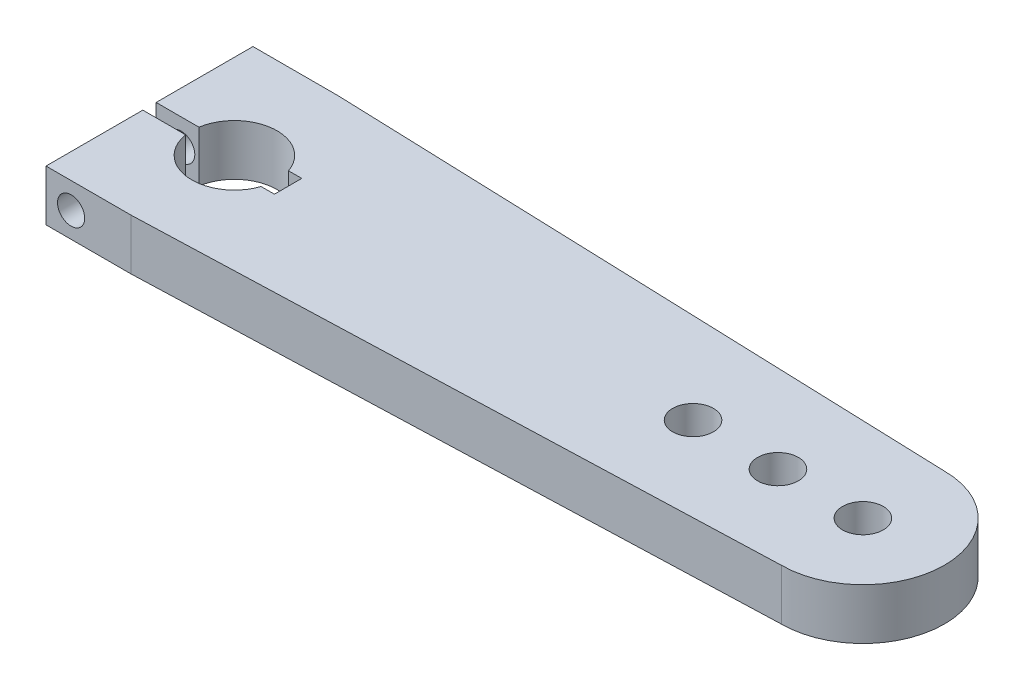
ISO-10303-21;
HEADER;
FILE_DESCRIPTION(('STEP AP214'),'2;1');
FILE_NAME('part.step','',(''),(''),'','','');
FILE_SCHEMA(('AUTOMOTIVE_DESIGN { 1 0 10303 214 1 1 1 1 }'));
ENDSEC;
DATA;
#1=APPLICATION_CONTEXT('core data for automotive mechanical design processes');
#2=APPLICATION_PROTOCOL_DEFINITION('international standard','automotive_design',2000,#1);
#3=PRODUCT_CONTEXT('',#1,'mechanical');
#4=PRODUCT('Part','Part','',(#3));
#5=PRODUCT_RELATED_PRODUCT_CATEGORY('part','',(#4));
#6=PRODUCT_DEFINITION_FORMATION('','',#4);
#7=PRODUCT_DEFINITION_CONTEXT('part definition',#1,'design');
#8=PRODUCT_DEFINITION('design','',#6,#7);
#9=PRODUCT_DEFINITION_SHAPE('','',#8);
#10=(LENGTH_UNIT() NAMED_UNIT(*) SI_UNIT(.MILLI.,.METRE.));
#11=(NAMED_UNIT(*) PLANE_ANGLE_UNIT() SI_UNIT($,.RADIAN.));
#12=(NAMED_UNIT(*) SI_UNIT($,.STERADIAN.) SOLID_ANGLE_UNIT());
#13=UNCERTAINTY_MEASURE_WITH_UNIT(LENGTH_MEASURE(1.E-05),#10,'distance_accuracy_value','');
#14=(GEOMETRIC_REPRESENTATION_CONTEXT(3) GLOBAL_UNCERTAINTY_ASSIGNED_CONTEXT((#13)) GLOBAL_UNIT_ASSIGNED_CONTEXT((#10,
#11,#12)) REPRESENTATION_CONTEXT('',''));
#15=CARTESIAN_POINT('',(0.,0.,0.));
#16=DIRECTION('',(0.,0.,1.));
#17=DIRECTION('',(1.,0.,0.));
#18=AXIS2_PLACEMENT_3D('',#15,#16,#17);
#19=CARTESIAN_POINT('',(92.1574881088771,15.,2.77365509217572));
#20=DIRECTION('',(0.,-1.,0.));
#21=DIRECTION('',(0.,0.,-1.));
#22=AXIS2_PLACEMENT_3D('',#19,#20,#21);
#23=PLANE('',#22);
#24=CARTESIAN_POINT('',(67.1574881088771,15.,2.77365509217573));
#25=DIRECTION('',(0.,1.,0.));
#26=DIRECTION('',(0.,0.,1.));
#27=AXIS2_PLACEMENT_3D('',#24,#25,#26);
#28=CIRCLE('',#27,6.);
#29=CARTESIAN_POINT('',(67.1574881088771,15.,8.77365509217573));
#30=VERTEX_POINT('',#29);
#31=EDGE_CURVE('E172',#30,#30,#28,.T.);
#32=ORIENTED_EDGE('',*,*,#31,.F.);
#33=EDGE_LOOP('',(#32));
#34=FACE_BOUND('',#33,.T.);
#35=CARTESIAN_POINT('',(42.1574881088771,15.,2.77365509217573));
#36=DIRECTION('',(0.,1.,0.));
#37=DIRECTION('',(0.,0.,1.));
#38=AXIS2_PLACEMENT_3D('',#35,#36,#37);
#39=CIRCLE('',#38,6.00000000000001);
#40=CARTESIAN_POINT('',(42.1574881088771,15.,8.77365509217573));
#41=VERTEX_POINT('',#40);
#42=EDGE_CURVE('E254',#41,#41,#39,.T.);
#43=ORIENTED_EDGE('',*,*,#42,.F.);
#44=EDGE_LOOP('',(#43));
#45=FACE_BOUND('',#44,.T.);
#46=CARTESIAN_POINT('',(92.1574881088771,15.,2.77365509217573));
#47=DIRECTION('',(0.,1.,0.));
#48=DIRECTION('',(0.,0.,1.));
#49=AXIS2_PLACEMENT_3D('',#46,#47,#48);
#50=CIRCLE('',#49,6.);
#51=CARTESIAN_POINT('',(92.1574881088771,15.,8.77365509217573));
#52=VERTEX_POINT('',#51);
#53=EDGE_CURVE('E248',#52,#52,#50,.T.);
#54=ORIENTED_EDGE('',*,*,#53,.F.);
#55=EDGE_LOOP('',(#54));
#56=FACE_BOUND('',#55,.T.);
#57=DIRECTION('',(1.,0.,0.));
#58=VECTOR('',#57,1.);
#59=CARTESIAN_POINT('',(-124.013504929194,15.,0.813312736203185));
#60=LINE('',#59,#58);
#61=CARTESIAN_POINT('',(-117.842511891123,15.,0.813312736203185));
#62=VERTEX_POINT('',#61);
#63=CARTESIAN_POINT('',(-105.238461142688,15.,0.813312736203186));
#64=VERTEX_POINT('',#63);
#65=EDGE_CURVE('E149',#62,#64,#60,.T.);
#66=ORIENTED_EDGE('',*,*,#65,.T.);
#67=CARTESIAN_POINT('',(-92.8425118911229,15.,2.77365509217573));
#68=DIRECTION('',(0.,1.,0.));
#69=DIRECTION('',(0.,0.,1.));
#70=AXIS2_PLACEMENT_3D('',#67,#68,#69);
#71=CIRCLE('',#70,12.55);
#72=CARTESIAN_POINT('',(-80.955465369804,15.,-1.25134490782428));
#73=VERTEX_POINT('',#72);
#74=EDGE_CURVE('E215',#73,#64,#71,.T.);
#75=ORIENTED_EDGE('',*,*,#74,.F.);
#76=DIRECTION('',(-1.,0.,0.));
#77=VECTOR('',#76,1.);
#78=CARTESIAN_POINT('',(-80.955465369804,15.,-1.25134490782428));
#79=LINE('',#78,#77);
#80=CARTESIAN_POINT('',(-77.0425118911229,15.,-1.25134490782428));
#81=VERTEX_POINT('',#80);
#82=EDGE_CURVE('E223',#81,#73,#79,.T.);
#83=ORIENTED_EDGE('',*,*,#82,.F.);
#84=DIRECTION('',(0.,0.,-1.));
#85=VECTOR('',#84,1.);
#86=CARTESIAN_POINT('',(-77.0425118911229,15.,-1.25134490782428));
#87=LINE('',#86,#85);
#88=CARTESIAN_POINT('',(-77.0425118911229,15.,6.79865509217572));
#89=VERTEX_POINT('',#88);
#90=EDGE_CURVE('E220',#89,#81,#87,.T.);
#91=ORIENTED_EDGE('',*,*,#90,.F.);
#92=DIRECTION('',(1.,0.,0.));
#93=VECTOR('',#92,1.);
#94=CARTESIAN_POINT('',(-80.955465369804,15.,6.79865509217572));
#95=LINE('',#94,#93);
#96=CARTESIAN_POINT('',(-80.955465369804,15.,6.79865509217572));
#97=VERTEX_POINT('',#96);
#98=EDGE_CURVE('E218',#97,#89,#95,.T.);
#99=ORIENTED_EDGE('',*,*,#98,.F.);
#100=CARTESIAN_POINT('',(-105.238461142688,15.,4.7339974481497));
#101=VERTEX_POINT('',#100);
#102=EDGE_CURVE('E148',#101,#97,#71,.T.);
#103=ORIENTED_EDGE('',*,*,#102,.F.);
#104=DIRECTION('',(1.,0.,0.));
#105=VECTOR('',#104,1.);
#106=CARTESIAN_POINT('',(-124.013504929194,15.,4.7339974481497));
#107=LINE('',#106,#105);
#108=CARTESIAN_POINT('',(-117.842511891123,15.,4.7339974481497));
#109=VERTEX_POINT('',#108);
#110=EDGE_CURVE('E49',#109,#101,#107,.T.);
#111=ORIENTED_EDGE('',*,*,#110,.F.);
#112=DIRECTION('',(0.,0.,1.));
#113=VECTOR('',#112,1.);
#114=CARTESIAN_POINT('',(-117.842511891123,15.,-27.6866872637968));
#115=LINE('',#114,#113);
#116=CARTESIAN_POINT('',(-117.842511891123,15.,33.2339974481497));
#117=VERTEX_POINT('',#116);
#118=EDGE_CURVE('E145',#109,#117,#115,.T.);
#119=ORIENTED_EDGE('',*,*,#118,.T.);
#120=DIRECTION('',(1.,0.,0.));
#121=VECTOR('',#120,1.);
#122=CARTESIAN_POINT('',(-92.8425118911229,15.,33.2339974481497));
#123=LINE('',#122,#121);
#124=CARTESIAN_POINT('',(-92.8425118911229,15.,33.2339974481497));
#125=VERTEX_POINT('',#124);
#126=EDGE_CURVE('E159',#117,#125,#123,.T.);
#127=ORIENTED_EDGE('',*,*,#126,.T.);
#128=DIRECTION('',(0.999390827019096,0.,-0.0348994967025044));
#129=VECTOR('',#128,1.);
#130=CARTESIAN_POINT('',(-92.8425118911229,15.,33.2339974481497));
#131=LINE('',#130,#129);
#132=CARTESIAN_POINT('',(92.1574881088771,15.,26.7736550921757));
#133=VERTEX_POINT('',#132);
#134=EDGE_CURVE('E165',#125,#133,#131,.T.);
#135=ORIENTED_EDGE('',*,*,#134,.T.);
#136=CARTESIAN_POINT('',(92.1574881088771,15.,2.77365509217572));
#137=DIRECTION('',(0.,1.,0.));
#138=DIRECTION('',(0.,0.,-1.));
#139=AXIS2_PLACEMENT_3D('',#136,#137,#138);
#140=CIRCLE('',#139,24.);
#141=CARTESIAN_POINT('',(92.1574881088771,15.,-21.2263449078243));
#142=VERTEX_POINT('',#141);
#143=EDGE_CURVE('E184',#133,#142,#140,.T.);
#144=ORIENTED_EDGE('',*,*,#143,.T.);
#145=DIRECTION('',(-0.999390827019096,0.,-0.0348994967024967));
#146=VECTOR('',#145,1.);
#147=CARTESIAN_POINT('',(-92.8425118911229,15.,-27.6866872637968));
#148=LINE('',#147,#146);
#149=CARTESIAN_POINT('',(-92.8425118911229,15.,-27.6866872637968));
#150=VERTEX_POINT('',#149);
#151=EDGE_CURVE('E160',#142,#150,#148,.T.);
#152=ORIENTED_EDGE('',*,*,#151,.T.);
#153=DIRECTION('',(-1.,0.,0.));
#154=VECTOR('',#153,1.);
#155=CARTESIAN_POINT('',(-92.8425118911229,15.,-27.6866872637968));
#156=LINE('',#155,#154);
#157=CARTESIAN_POINT('',(-117.842511891123,15.,-27.6866872637968));
#158=VERTEX_POINT('',#157);
#159=EDGE_CURVE('E156',#150,#158,#156,.T.);
#160=ORIENTED_EDGE('',*,*,#159,.T.);
#161=EDGE_CURVE('E155',#158,#62,#115,.T.);
#162=ORIENTED_EDGE('',*,*,#161,.T.);
#163=EDGE_LOOP('',(#66,#75,#83,#91,#99,#103,#111,#119,#127,#135,#144,#152,#160,#162));
#164=FACE_BOUND('',#163,.T.);
#165=ADVANCED_FACE('F32',(#34,#45,#56,#164),#23,.F.);
#166=CARTESIAN_POINT('',(92.1574881088771,0.,2.77365509217572));
#167=DIRECTION('',(0.,-1.,0.));
#168=DIRECTION('',(0.,0.,-1.));
#169=AXIS2_PLACEMENT_3D('',#166,#167,#168);
#170=PLANE('',#169);
#171=CARTESIAN_POINT('',(42.1574881088771,0.,2.77365509217573));
#172=DIRECTION('',(0.,1.,0.));
#173=DIRECTION('',(0.,0.,1.));
#174=AXIS2_PLACEMENT_3D('',#171,#172,#173);
#175=CIRCLE('',#174,6.00000000000001);
#176=CARTESIAN_POINT('',(42.1574881088771,0.,8.77365509217573));
#177=VERTEX_POINT('',#176);
#178=EDGE_CURVE('E251',#177,#177,#175,.T.);
#179=ORIENTED_EDGE('',*,*,#178,.T.);
#180=EDGE_LOOP('',(#179));
#181=FACE_BOUND('',#180,.T.);
#182=CARTESIAN_POINT('',(67.1574881088771,0.,2.77365509217573));
#183=DIRECTION('',(0.,1.,0.));
#184=DIRECTION('',(0.,0.,1.));
#185=AXIS2_PLACEMENT_3D('',#182,#183,#184);
#186=CIRCLE('',#185,6.);
#187=CARTESIAN_POINT('',(67.1574881088771,0.,8.77365509217573));
#188=VERTEX_POINT('',#187);
#189=EDGE_CURVE('E257',#188,#188,#186,.T.);
#190=ORIENTED_EDGE('',*,*,#189,.T.);
#191=EDGE_LOOP('',(#190));
#192=FACE_BOUND('',#191,.T.);
#193=CARTESIAN_POINT('',(92.1574881088771,0.,2.77365509217573));
#194=DIRECTION('',(0.,1.,0.));
#195=DIRECTION('',(0.,0.,1.));
#196=AXIS2_PLACEMENT_3D('',#193,#194,#195);
#197=CIRCLE('',#196,6.);
#198=CARTESIAN_POINT('',(92.1574881088771,0.,8.77365509217573));
#199=VERTEX_POINT('',#198);
#200=EDGE_CURVE('E247',#199,#199,#197,.T.);
#201=ORIENTED_EDGE('',*,*,#200,.T.);
#202=EDGE_LOOP('',(#201));
#203=FACE_BOUND('',#202,.T.);
#204=CARTESIAN_POINT('',(-92.8425118911229,0.,2.77365509217573));
#205=DIRECTION('',(0.,1.,0.));
#206=DIRECTION('',(0.,0.,1.));
#207=AXIS2_PLACEMENT_3D('',#204,#205,#206);
#208=CIRCLE('',#207,12.55);
#209=CARTESIAN_POINT('',(-80.955465369804,0.,-1.25134490782427));
#210=VERTEX_POINT('',#209);
#211=CARTESIAN_POINT('',(-105.238461142688,0.,0.813312736203187));
#212=VERTEX_POINT('',#211);
#213=EDGE_CURVE('E226',#210,#212,#208,.T.);
#214=ORIENTED_EDGE('',*,*,#213,.T.);
#215=DIRECTION('',(1.,0.,0.));
#216=VECTOR('',#215,1.);
#217=CARTESIAN_POINT('',(-124.013504929194,0.,0.813312736203185));
#218=LINE('',#217,#216);
#219=CARTESIAN_POINT('',(-117.842511891123,0.,0.813312736203185));
#220=VERTEX_POINT('',#219);
#221=EDGE_CURVE('E57',#220,#212,#218,.T.);
#222=ORIENTED_EDGE('',*,*,#221,.F.);
#223=DIRECTION('',(0.,0.,1.));
#224=VECTOR('',#223,1.);
#225=CARTESIAN_POINT('',(-117.842511891123,0.,-27.6866872637968));
#226=LINE('',#225,#224);
#227=CARTESIAN_POINT('',(-117.842511891123,0.,-27.6866872637968));
#228=VERTEX_POINT('',#227);
#229=EDGE_CURVE('E177',#228,#220,#226,.T.);
#230=ORIENTED_EDGE('',*,*,#229,.F.);
#231=DIRECTION('',(-1.,0.,0.));
#232=VECTOR('',#231,1.);
#233=CARTESIAN_POINT('',(-92.8425118911229,0.,-27.6866872637968));
#234=LINE('',#233,#232);
#235=CARTESIAN_POINT('',(-92.8425118911229,0.,-27.6866872637968));
#236=VERTEX_POINT('',#235);
#237=EDGE_CURVE('E174',#236,#228,#234,.T.);
#238=ORIENTED_EDGE('',*,*,#237,.F.);
#239=DIRECTION('',(-0.999390827019096,0.,-0.0348994967024967));
#240=VECTOR('',#239,1.);
#241=CARTESIAN_POINT('',(-92.8425118911229,0.,-27.6866872637968));
#242=LINE('',#241,#240);
#243=CARTESIAN_POINT('',(92.1574881088771,0.,-21.2263449078243));
#244=VERTEX_POINT('',#243);
#245=EDGE_CURVE('E171',#244,#236,#242,.T.);
#246=ORIENTED_EDGE('',*,*,#245,.F.);
#247=CARTESIAN_POINT('',(92.1574881088771,0.,2.77365509217572));
#248=DIRECTION('',(0.,1.,0.));
#249=DIRECTION('',(0.,0.,-1.));
#250=AXIS2_PLACEMENT_3D('',#247,#248,#249);
#251=CIRCLE('',#250,24.);
#252=CARTESIAN_POINT('',(92.1574881088771,0.,26.7736550921757));
#253=VERTEX_POINT('',#252);
#254=EDGE_CURVE('E168',#253,#244,#251,.T.);
#255=ORIENTED_EDGE('',*,*,#254,.F.);
#256=DIRECTION('',(0.999390827019096,0.,-0.0348994967025044));
#257=VECTOR('',#256,1.);
#258=CARTESIAN_POINT('',(-92.8425118911229,0.,33.2339974481497));
#259=LINE('',#258,#257);
#260=CARTESIAN_POINT('',(-92.8425118911229,0.,33.2339974481497));
#261=VERTEX_POINT('',#260);
#262=EDGE_CURVE('E182',#261,#253,#259,.T.);
#263=ORIENTED_EDGE('',*,*,#262,.F.);
#264=DIRECTION('',(1.,0.,0.));
#265=VECTOR('',#264,1.);
#266=CARTESIAN_POINT('',(-92.8425118911229,0.,33.2339974481497));
#267=LINE('',#266,#265);
#268=CARTESIAN_POINT('',(-117.842511891123,0.,33.2339974481497));
#269=VERTEX_POINT('',#268);
#270=EDGE_CURVE('E180',#269,#261,#267,.T.);
#271=ORIENTED_EDGE('',*,*,#270,.F.);
#272=CARTESIAN_POINT('',(-117.842511891123,0.,4.7339974481497));
#273=VERTEX_POINT('',#272);
#274=EDGE_CURVE('E176',#273,#269,#226,.T.);
#275=ORIENTED_EDGE('',*,*,#274,.F.);
#276=DIRECTION('',(1.,0.,0.));
#277=VECTOR('',#276,1.);
#278=CARTESIAN_POINT('',(-124.013504929194,0.,4.7339974481497));
#279=LINE('',#278,#277);
#280=CARTESIAN_POINT('',(-105.238461142688,0.,4.7339974481497));
#281=VERTEX_POINT('',#280);
#282=EDGE_CURVE('E136',#273,#281,#279,.T.);
#283=ORIENTED_EDGE('',*,*,#282,.T.);
#284=CARTESIAN_POINT('',(-80.955465369804,0.,6.79865509217572));
#285=VERTEX_POINT('',#284);
#286=EDGE_CURVE('E214',#281,#285,#208,.T.);
#287=ORIENTED_EDGE('',*,*,#286,.T.);
#288=DIRECTION('',(1.,0.,0.));
#289=VECTOR('',#288,1.);
#290=CARTESIAN_POINT('',(-80.955465369804,0.,6.79865509217572));
#291=LINE('',#290,#289);
#292=CARTESIAN_POINT('',(-77.0425118911229,0.,6.79865509217572));
#293=VERTEX_POINT('',#292);
#294=EDGE_CURVE('E229',#285,#293,#291,.T.);
#295=ORIENTED_EDGE('',*,*,#294,.T.);
#296=DIRECTION('',(0.,0.,-1.));
#297=VECTOR('',#296,1.);
#298=CARTESIAN_POINT('',(-77.0425118911229,0.,-1.25134490782428));
#299=LINE('',#298,#297);
#300=CARTESIAN_POINT('',(-77.0425118911229,0.,-1.25134490782428));
#301=VERTEX_POINT('',#300);
#302=EDGE_CURVE('E232',#293,#301,#299,.T.);
#303=ORIENTED_EDGE('',*,*,#302,.T.);
#304=DIRECTION('',(-1.,0.,0.));
#305=VECTOR('',#304,1.);
#306=CARTESIAN_POINT('',(-80.955465369804,0.,-1.25134490782428));
#307=LINE('',#306,#305);
#308=EDGE_CURVE('E235',#301,#210,#307,.T.);
#309=ORIENTED_EDGE('',*,*,#308,.T.);
#310=EDGE_LOOP('',(#214,#222,#230,#238,#246,#255,#263,#271,#275,#283,#287,#295,#303,#309));
#311=FACE_BOUND('',#310,.T.);
#312=ADVANCED_FACE('F289',(#181,#192,#203,#311),#170,.T.);
#313=CARTESIAN_POINT('',(-117.842511891123,15.,-27.6866872637968));
#314=DIRECTION('',(1.,0.,0.));
#315=DIRECTION('',(0.,0.,-1.));
#316=AXIS2_PLACEMENT_3D('',#313,#314,#315);
#317=PLANE('',#316);
#318=DIRECTION('',(0.,-1.,0.));
#319=VECTOR('',#318,1.);
#320=CARTESIAN_POINT('',(-117.842511891123,15.,0.813312736203185));
#321=LINE('',#320,#319);
#322=EDGE_CURVE('E206',#62,#220,#321,.T.);
#323=ORIENTED_EDGE('',*,*,#322,.F.);
#324=ORIENTED_EDGE('',*,*,#161,.F.);
#325=DIRECTION('',(0.,-1.,0.));
#326=VECTOR('',#325,1.);
#327=CARTESIAN_POINT('',(-117.842511891123,15.,-27.6866872637968));
#328=LINE('',#327,#326);
#329=EDGE_CURVE('E191',#158,#228,#328,.T.);
#330=ORIENTED_EDGE('',*,*,#329,.T.);
#331=ORIENTED_EDGE('',*,*,#229,.T.);
#332=EDGE_LOOP('',(#323,#324,#330,#331));
#333=FACE_BOUND('',#332,.T.);
#334=ADVANCED_FACE('F279',(#333),#317,.F.);
#335=CARTESIAN_POINT('',(-92.8425118911229,15.,2.77365509217573));
#336=DIRECTION('',(0.,-1.,0.));
#337=DIRECTION('',(0.,0.,-1.));
#338=AXIS2_PLACEMENT_3D('',#335,#336,#337);
#339=CYLINDRICAL_SURFACE('',#338,12.55);
#340=ORIENTED_EDGE('',*,*,#74,.T.);
#341=DIRECTION('',(0.,-1.,0.));
#342=VECTOR('',#341,1.);
#343=CARTESIAN_POINT('',(-105.238461142688,15.,0.813312736203186));
#344=LINE('',#343,#342);
#345=EDGE_CURVE('E204',#64,#212,#344,.T.);
#346=ORIENTED_EDGE('',*,*,#345,.T.);
#347=ORIENTED_EDGE('',*,*,#213,.F.);
#348=DIRECTION('',(0.,-1.,0.));
#349=VECTOR('',#348,1.);
#350=CARTESIAN_POINT('',(-80.955465369804,15.,-1.25134490782428));
#351=LINE('',#350,#349);
#352=EDGE_CURVE('E225',#73,#210,#351,.T.);
#353=ORIENTED_EDGE('',*,*,#352,.F.);
#354=EDGE_LOOP('',(#340,#346,#347,#353));
#355=FACE_BOUND('',#354,.T.);
#356=ADVANCED_FACE('F284',(#355),#339,.F.);
#357=CARTESIAN_POINT('',(-110.462160830366,7.3692509347012,33.2339974481497));
#358=DIRECTION('',(0.,0.,-1.));
#359=DIRECTION('',(-1.,0.,0.));
#360=AXIS2_PLACEMENT_3D('',#357,#358,#359);
#361=CYLINDRICAL_SURFACE('',#360,4.00000000000001);
#362=CARTESIAN_POINT('',(-110.462160830366,7.3692509347012,-27.6866872637968));
#363=DIRECTION('',(0.,0.,-1.));
#364=DIRECTION('',(-1.,0.,0.));
#365=AXIS2_PLACEMENT_3D('',#362,#363,#364);
#366=CIRCLE('',#365,4.00000000000001);
#367=CARTESIAN_POINT('',(-114.462160830366,7.3692509347012,-27.6866872637968));
#368=VERTEX_POINT('',#367);
#369=EDGE_CURVE('E208',#368,#368,#366,.T.);
#370=ORIENTED_EDGE('',*,*,#369,.T.);
#371=EDGE_LOOP('',(#370));
#372=FACE_BOUND('',#371,.T.);
#373=CARTESIAN_POINT('',(-110.462160830366,7.3692509347012,0.813312736203185));
#374=DIRECTION('',(0.,0.,1.));
#375=DIRECTION('',(1.,0.,0.));
#376=AXIS2_PLACEMENT_3D('',#373,#374,#375);
#377=CIRCLE('',#376,4.00000000000001);
#378=CARTESIAN_POINT('',(-106.462160830366,7.3692509347012,0.813312736203185));
#379=VERTEX_POINT('',#378);
#380=EDGE_CURVE('E36',#379,#379,#377,.F.);
#381=ORIENTED_EDGE('',*,*,#380,.F.);
#382=EDGE_LOOP('',(#381));
#383=FACE_BOUND('',#382,.T.);
#384=ADVANCED_FACE('F314',(#372,#383),#361,.F.);
#385=CARTESIAN_POINT('',(92.1574881088771,15.,2.77365509217572));
#386=DIRECTION('',(0.,-1.,0.));
#387=DIRECTION('',(0.,0.,-1.));
#388=AXIS2_PLACEMENT_3D('',#385,#386,#387);
#389=CYLINDRICAL_SURFACE('',#388,24.);
#390=ORIENTED_EDGE('',*,*,#254,.T.);
#391=DIRECTION('',(0.,-1.,0.));
#392=VECTOR('',#391,1.);
#393=CARTESIAN_POINT('',(92.1574881088771,15.,-21.2263449078243));
#394=LINE('',#393,#392);
#395=EDGE_CURVE('E11',#142,#244,#394,.T.);
#396=ORIENTED_EDGE('',*,*,#395,.F.);
#397=ORIENTED_EDGE('',*,*,#143,.F.);
#398=DIRECTION('',(0.,-1.,0.));
#399=VECTOR('',#398,1.);
#400=CARTESIAN_POINT('',(92.1574881088771,15.,26.7736550921757));
#401=LINE('',#400,#399);
#402=EDGE_CURVE('E167',#133,#253,#401,.T.);
#403=ORIENTED_EDGE('',*,*,#402,.T.);
#404=EDGE_LOOP('',(#390,#396,#397,#403));
#405=FACE_BOUND('',#404,.T.);
#406=ADVANCED_FACE('F34',(#405),#389,.T.);
#407=CARTESIAN_POINT('',(-92.8425118911229,15.,-27.6866872637968));
#408=DIRECTION('',(-0.0348994967024967,0.,0.999390827019096));
#409=DIRECTION('',(0.999390827019096,0.,0.0348994967024967));
#410=AXIS2_PLACEMENT_3D('',#407,#408,#409);
#411=PLANE('',#410);
#412=ORIENTED_EDGE('',*,*,#245,.T.);
#413=DIRECTION('',(0.,-1.,0.));
#414=VECTOR('',#413,1.);
#415=CARTESIAN_POINT('',(-92.8425118911229,15.,-27.6866872637968));
#416=LINE('',#415,#414);
#417=EDGE_CURVE('E41',#150,#236,#416,.T.);
#418=ORIENTED_EDGE('',*,*,#417,.F.);
#419=ORIENTED_EDGE('',*,*,#151,.F.);
#420=ORIENTED_EDGE('',*,*,#395,.T.);
#421=EDGE_LOOP('',(#412,#418,#419,#420));
#422=FACE_BOUND('',#421,.T.);
#423=ADVANCED_FACE('F271',(#422),#411,.F.);
#424=CARTESIAN_POINT('',(-92.8425118911229,15.,-27.6866872637968));
#425=DIRECTION('',(0.,0.,1.));
#426=DIRECTION('',(1.,0.,0.));
#427=AXIS2_PLACEMENT_3D('',#424,#425,#426);
#428=PLANE('',#427);
#429=ORIENTED_EDGE('',*,*,#369,.F.);
#430=EDGE_LOOP('',(#429));
#431=FACE_BOUND('',#430,.T.);
#432=ORIENTED_EDGE('',*,*,#237,.T.);
#433=ORIENTED_EDGE('',*,*,#329,.F.);
#434=ORIENTED_EDGE('',*,*,#159,.F.);
#435=ORIENTED_EDGE('',*,*,#417,.T.);
#436=EDGE_LOOP('',(#432,#433,#434,#435));
#437=FACE_BOUND('',#436,.T.);
#438=ADVANCED_FACE('F274',(#431,#437),#428,.F.);
#439=ORIENTED_EDGE('',*,*,#118,.F.);
#440=DIRECTION('',(0.,-1.,0.));
#441=VECTOR('',#440,1.);
#442=CARTESIAN_POINT('',(-117.842511891123,15.,4.7339974481497));
#443=LINE('',#442,#441);
#444=EDGE_CURVE('E133',#109,#273,#443,.T.);
#445=ORIENTED_EDGE('',*,*,#444,.T.);
#446=ORIENTED_EDGE('',*,*,#274,.T.);
#447=DIRECTION('',(0.,-1.,0.));
#448=VECTOR('',#447,1.);
#449=CARTESIAN_POINT('',(-117.842511891123,15.,33.2339974481497));
#450=LINE('',#449,#448);
#451=EDGE_CURVE('E153',#117,#269,#450,.T.);
#452=ORIENTED_EDGE('',*,*,#451,.F.);
#453=EDGE_LOOP('',(#439,#445,#446,#452));
#454=FACE_BOUND('',#453,.T.);
#455=ADVANCED_FACE('F151',(#454),#317,.F.);
#456=CARTESIAN_POINT('',(-92.8425118911229,15.,33.2339974481497));
#457=DIRECTION('',(0.,0.,-1.));
#458=DIRECTION('',(-1.,0.,0.));
#459=AXIS2_PLACEMENT_3D('',#456,#457,#458);
#460=PLANE('',#459);
#461=CARTESIAN_POINT('',(-110.462160830366,7.3692509347012,33.2339974481497));
#462=DIRECTION('',(0.,0.,-1.));
#463=DIRECTION('',(-1.,0.,0.));
#464=AXIS2_PLACEMENT_3D('',#461,#462,#463);
#465=CIRCLE('',#464,4.00000000000001);
#466=CARTESIAN_POINT('',(-114.462160830366,7.3692509347012,33.2339974481497));
#467=VERTEX_POINT('',#466);
#468=EDGE_CURVE('E211',#467,#467,#465,.T.);
#469=ORIENTED_EDGE('',*,*,#468,.T.);
#470=EDGE_LOOP('',(#469));
#471=FACE_BOUND('',#470,.T.);
#472=ORIENTED_EDGE('',*,*,#270,.T.);
#473=DIRECTION('',(0.,-1.,0.));
#474=VECTOR('',#473,1.);
#475=CARTESIAN_POINT('',(-92.8425118911229,15.,33.2339974481497));
#476=LINE('',#475,#474);
#477=EDGE_CURVE('E187',#125,#261,#476,.T.);
#478=ORIENTED_EDGE('',*,*,#477,.F.);
#479=ORIENTED_EDGE('',*,*,#126,.F.);
#480=ORIENTED_EDGE('',*,*,#451,.T.);
#481=EDGE_LOOP('',(#472,#478,#479,#480));
#482=FACE_BOUND('',#481,.T.);
#483=ADVANCED_FACE('F305',(#471,#482),#460,.F.);
#484=CARTESIAN_POINT('',(-92.8425118911229,15.,33.2339974481497));
#485=DIRECTION('',(-0.0348994967025044,0.,-0.999390827019096));
#486=DIRECTION('',(-0.999390827019096,0.,0.0348994967025044));
#487=AXIS2_PLACEMENT_3D('',#484,#485,#486);
#488=PLANE('',#487);
#489=ORIENTED_EDGE('',*,*,#262,.T.);
#490=ORIENTED_EDGE('',*,*,#402,.F.);
#491=ORIENTED_EDGE('',*,*,#134,.F.);
#492=ORIENTED_EDGE('',*,*,#477,.T.);
#493=EDGE_LOOP('',(#489,#490,#491,#492));
#494=FACE_BOUND('',#493,.T.);
#495=ADVANCED_FACE('F310',(#494),#488,.F.);
#496=CARTESIAN_POINT('',(67.1574881088771,15.,2.77365509217573));
#497=DIRECTION('',(0.,-1.,0.));
#498=DIRECTION('',(0.,0.,-1.));
#499=AXIS2_PLACEMENT_3D('',#496,#497,#498);
#500=CYLINDRICAL_SURFACE('',#499,6.);
#501=ORIENTED_EDGE('',*,*,#31,.T.);
#502=EDGE_LOOP('',(#501));
#503=FACE_BOUND('',#502,.T.);
#504=ORIENTED_EDGE('',*,*,#189,.F.);
#505=EDGE_LOOP('',(#504));
#506=FACE_BOUND('',#505,.T.);
#507=ADVANCED_FACE('F333',(#503,#506),#500,.F.);
#508=CARTESIAN_POINT('',(42.1574881088771,15.,2.77365509217573));
#509=DIRECTION('',(0.,-1.,0.));
#510=DIRECTION('',(0.,0.,-1.));
#511=AXIS2_PLACEMENT_3D('',#508,#509,#510);
#512=CYLINDRICAL_SURFACE('',#511,6.00000000000001);
#513=ORIENTED_EDGE('',*,*,#42,.T.);
#514=EDGE_LOOP('',(#513));
#515=FACE_BOUND('',#514,.T.);
#516=ORIENTED_EDGE('',*,*,#178,.F.);
#517=EDGE_LOOP('',(#516));
#518=FACE_BOUND('',#517,.T.);
#519=ADVANCED_FACE('F372',(#515,#518),#512,.F.);
#520=CARTESIAN_POINT('',(92.1574881088771,15.,2.77365509217573));
#521=DIRECTION('',(0.,-1.,0.));
#522=DIRECTION('',(0.,0.,-1.));
#523=AXIS2_PLACEMENT_3D('',#520,#521,#522);
#524=CYLINDRICAL_SURFACE('',#523,6.);
#525=ORIENTED_EDGE('',*,*,#53,.T.);
#526=EDGE_LOOP('',(#525));
#527=FACE_BOUND('',#526,.T.);
#528=ORIENTED_EDGE('',*,*,#200,.F.);
#529=EDGE_LOOP('',(#528));
#530=FACE_BOUND('',#529,.T.);
#531=ADVANCED_FACE('F370',(#527,#530),#524,.F.);
#532=DIRECTION('',(0.,-1.,0.));
#533=VECTOR('',#532,1.);
#534=CARTESIAN_POINT('',(-105.238461142688,15.,4.7339974481497));
#535=LINE('',#534,#533);
#536=EDGE_CURVE('E140',#101,#281,#535,.T.);
#537=ORIENTED_EDGE('',*,*,#536,.F.);
#538=ORIENTED_EDGE('',*,*,#102,.T.);
#539=DIRECTION('',(0.,-1.,0.));
#540=VECTOR('',#539,1.);
#541=CARTESIAN_POINT('',(-80.955465369804,15.,6.79865509217572));
#542=LINE('',#541,#540);
#543=EDGE_CURVE('E244',#97,#285,#542,.T.);
#544=ORIENTED_EDGE('',*,*,#543,.T.);
#545=ORIENTED_EDGE('',*,*,#286,.F.);
#546=EDGE_LOOP('',(#537,#538,#544,#545));
#547=FACE_BOUND('',#546,.T.);
#548=ADVANCED_FACE('F301',(#547),#339,.F.);
#549=CARTESIAN_POINT('',(-80.955465369804,15.,6.79865509217572));
#550=DIRECTION('',(0.,0.,-1.));
#551=DIRECTION('',(-1.,0.,0.));
#552=AXIS2_PLACEMENT_3D('',#549,#550,#551);
#553=PLANE('',#552);
#554=ORIENTED_EDGE('',*,*,#294,.F.);
#555=ORIENTED_EDGE('',*,*,#543,.F.);
#556=ORIENTED_EDGE('',*,*,#98,.T.);
#557=DIRECTION('',(0.,-1.,0.));
#558=VECTOR('',#557,1.);
#559=CARTESIAN_POINT('',(-77.0425118911229,15.,6.79865509217572));
#560=LINE('',#559,#558);
#561=EDGE_CURVE('E242',#89,#293,#560,.T.);
#562=ORIENTED_EDGE('',*,*,#561,.T.);
#563=EDGE_LOOP('',(#554,#555,#556,#562));
#564=FACE_BOUND('',#563,.T.);
#565=ADVANCED_FACE('F298',(#564),#553,.T.);
#566=CARTESIAN_POINT('',(-77.0425118911229,15.,-1.25134490782428));
#567=DIRECTION('',(-1.,0.,0.));
#568=DIRECTION('',(0.,0.,1.));
#569=AXIS2_PLACEMENT_3D('',#566,#567,#568);
#570=PLANE('',#569);
#571=ORIENTED_EDGE('',*,*,#302,.F.);
#572=ORIENTED_EDGE('',*,*,#561,.F.);
#573=ORIENTED_EDGE('',*,*,#90,.T.);
#574=DIRECTION('',(0.,-1.,0.));
#575=VECTOR('',#574,1.);
#576=CARTESIAN_POINT('',(-77.0425118911229,15.,-1.25134490782428));
#577=LINE('',#576,#575);
#578=EDGE_CURVE('E240',#81,#301,#577,.T.);
#579=ORIENTED_EDGE('',*,*,#578,.T.);
#580=EDGE_LOOP('',(#571,#572,#573,#579));
#581=FACE_BOUND('',#580,.T.);
#582=ADVANCED_FACE('F294',(#581),#570,.T.);
#583=CARTESIAN_POINT('',(-80.955465369804,15.,-1.25134490782428));
#584=DIRECTION('',(0.,0.,1.));
#585=DIRECTION('',(1.,0.,0.));
#586=AXIS2_PLACEMENT_3D('',#583,#584,#585);
#587=PLANE('',#586);
#588=ORIENTED_EDGE('',*,*,#308,.F.);
#589=ORIENTED_EDGE('',*,*,#578,.F.);
#590=ORIENTED_EDGE('',*,*,#82,.T.);
#591=ORIENTED_EDGE('',*,*,#352,.T.);
#592=EDGE_LOOP('',(#588,#589,#590,#591));
#593=FACE_BOUND('',#592,.T.);
#594=ADVANCED_FACE('F287',(#593),#587,.T.);
#595=CARTESIAN_POINT('',(-110.462160830366,7.3692509347012,4.7339974481497));
#596=DIRECTION('',(0.,0.,1.));
#597=DIRECTION('',(1.,0.,0.));
#598=AXIS2_PLACEMENT_3D('',#595,#596,#597);
#599=CIRCLE('',#598,4.00000000000001);
#600=CARTESIAN_POINT('',(-106.462160830366,7.3692509347012,4.7339974481497));
#601=VERTEX_POINT('',#600);
#602=EDGE_CURVE('E195',#601,#601,#599,.F.);
#603=ORIENTED_EDGE('',*,*,#602,.T.);
#604=EDGE_LOOP('',(#603));
#605=FACE_BOUND('',#604,.T.);
#606=ORIENTED_EDGE('',*,*,#468,.F.);
#607=EDGE_LOOP('',(#606));
#608=FACE_BOUND('',#607,.T.);
#609=ADVANCED_FACE('F321',(#605,#608),#361,.F.);
#610=CARTESIAN_POINT('',(-124.013504929194,0.,4.7339974481497));
#611=DIRECTION('',(0.,0.,1.));
#612=DIRECTION('',(1.,0.,0.));
#613=AXIS2_PLACEMENT_3D('',#610,#611,#612);
#614=PLANE('',#613);
#615=ORIENTED_EDGE('',*,*,#602,.F.);
#616=EDGE_LOOP('',(#615));
#617=FACE_BOUND('',#616,.T.);
#618=ORIENTED_EDGE('',*,*,#110,.T.);
#619=ORIENTED_EDGE('',*,*,#536,.T.);
#620=ORIENTED_EDGE('',*,*,#282,.F.);
#621=ORIENTED_EDGE('',*,*,#444,.F.);
#622=EDGE_LOOP('',(#618,#619,#620,#621));
#623=FACE_BOUND('',#622,.T.);
#624=ADVANCED_FACE('F134',(#617,#623),#614,.F.);
#625=CARTESIAN_POINT('',(-124.013504929194,0.,0.813312736203185));
#626=DIRECTION('',(0.,0.,1.));
#627=DIRECTION('',(1.,0.,0.));
#628=AXIS2_PLACEMENT_3D('',#625,#626,#627);
#629=PLANE('',#628);
#630=ORIENTED_EDGE('',*,*,#380,.T.);
#631=EDGE_LOOP('',(#630));
#632=FACE_BOUND('',#631,.T.);
#633=ORIENTED_EDGE('',*,*,#322,.T.);
#634=ORIENTED_EDGE('',*,*,#221,.T.);
#635=ORIENTED_EDGE('',*,*,#345,.F.);
#636=ORIENTED_EDGE('',*,*,#65,.F.);
#637=EDGE_LOOP('',(#633,#634,#635,#636));
#638=FACE_BOUND('',#637,.T.);
#639=ADVANCED_FACE('F352',(#632,#638),#629,.T.);
#640=CLOSED_SHELL('',(#165,#312,#334,#356,#384,#406,#423,#438,#455,#483,#495,#507,#519,#531,
#548,#565,#582,#594,#609,#624,#639));
#641=MANIFOLD_SOLID_BREP('B2',#640);
#642=ADVANCED_BREP_SHAPE_REPRESENTATION('',(#18,#641),#14);
#643=SHAPE_DEFINITION_REPRESENTATION(#9,#642);
ENDSEC;
END-ISO-10303-21;
